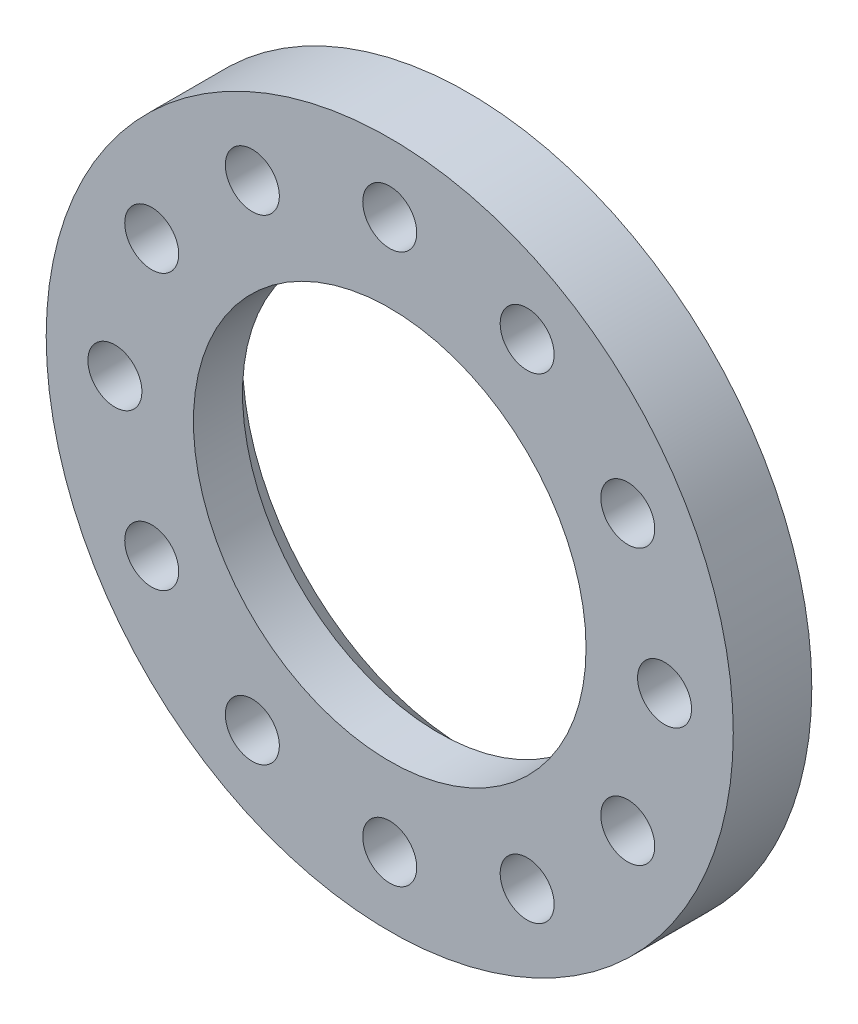
ISO-10303-21;
HEADER;
FILE_DESCRIPTION(('STEP AP214'),'2;1');
FILE_NAME('part.step','',(''),(''),'','','');
FILE_SCHEMA(('AUTOMOTIVE_DESIGN { 1 0 10303 214 1 1 1 1 }'));
ENDSEC;
DATA;
#1=APPLICATION_CONTEXT('core data for automotive mechanical design processes');
#2=APPLICATION_PROTOCOL_DEFINITION('international standard','automotive_design',2000,#1);
#3=PRODUCT_CONTEXT('',#1,'mechanical');
#4=PRODUCT('Part','Part','',(#3));
#5=PRODUCT_RELATED_PRODUCT_CATEGORY('part','',(#4));
#6=PRODUCT_DEFINITION_FORMATION('','',#4);
#7=PRODUCT_DEFINITION_CONTEXT('part definition',#1,'design');
#8=PRODUCT_DEFINITION('design','',#6,#7);
#9=PRODUCT_DEFINITION_SHAPE('','',#8);
#10=(LENGTH_UNIT() NAMED_UNIT(*) SI_UNIT(.MILLI.,.METRE.));
#11=(NAMED_UNIT(*) PLANE_ANGLE_UNIT() SI_UNIT($,.RADIAN.));
#12=(NAMED_UNIT(*) SI_UNIT($,.STERADIAN.) SOLID_ANGLE_UNIT());
#13=UNCERTAINTY_MEASURE_WITH_UNIT(LENGTH_MEASURE(1.E-05),#10,'distance_accuracy_value','');
#14=(GEOMETRIC_REPRESENTATION_CONTEXT(3) GLOBAL_UNCERTAINTY_ASSIGNED_CONTEXT((#13)) GLOBAL_UNIT_ASSIGNED_CONTEXT((#10,
#11,#12)) REPRESENTATION_CONTEXT('',''));
#15=CARTESIAN_POINT('',(0.,0.,0.));
#16=DIRECTION('',(0.,0.,1.));
#17=DIRECTION('',(1.,0.,0.));
#18=AXIS2_PLACEMENT_3D('',#15,#16,#17);
#19=CARTESIAN_POINT('',(0.,0.,-464.));
#20=DIRECTION('',(0.,0.,1.));
#21=DIRECTION('',(1.,0.,0.));
#22=AXIS2_PLACEMENT_3D('',#19,#20,#21);
#23=PLANE('',#22);
#24=CARTESIAN_POINT('',(24.2487113059641,14.0000000000002,-464.));
#25=DIRECTION('',(0.,0.,-1.));
#26=DIRECTION('',(-1.,0.,0.));
#27=AXIS2_PLACEMENT_3D('',#24,#25,#26);
#28=CIRCLE('',#27,2.75);
#29=CARTESIAN_POINT('',(21.4987113059641,14.0000000000002,-464.));
#30=VERTEX_POINT('',#29);
#31=EDGE_CURVE('E132',#30,#30,#28,.T.);
#32=ORIENTED_EDGE('',*,*,#31,.F.);
#33=EDGE_LOOP('',(#32));
#34=FACE_BOUND('',#33,.T.);
#35=CARTESIAN_POINT('',(13.9999999999997,24.2487113059645,-464.));
#36=DIRECTION('',(0.,0.,-1.));
#37=DIRECTION('',(-1.,0.,0.));
#38=AXIS2_PLACEMENT_3D('',#35,#36,#37);
#39=CIRCLE('',#38,2.75);
#40=CARTESIAN_POINT('',(11.2499999999997,24.2487113059645,-464.));
#41=VERTEX_POINT('',#40);
#42=EDGE_CURVE('E126',#41,#41,#39,.T.);
#43=ORIENTED_EDGE('',*,*,#42,.F.);
#44=EDGE_LOOP('',(#43));
#45=FACE_BOUND('',#44,.T.);
#46=CARTESIAN_POINT('',(0.,28.,-464.));
#47=DIRECTION('',(0.,0.,-1.));
#48=DIRECTION('',(-1.,0.,0.));
#49=AXIS2_PLACEMENT_3D('',#46,#47,#48);
#50=CIRCLE('',#49,2.75);
#51=CARTESIAN_POINT('',(-2.75,28.,-464.));
#52=VERTEX_POINT('',#51);
#53=EDGE_CURVE('E120',#52,#52,#50,.T.);
#54=ORIENTED_EDGE('',*,*,#53,.F.);
#55=EDGE_LOOP('',(#54));
#56=FACE_BOUND('',#55,.T.);
#57=CARTESIAN_POINT('',(-14.,24.2487113059643,-464.));
#58=DIRECTION('',(0.,0.,-1.));
#59=DIRECTION('',(-1.,0.,0.));
#60=AXIS2_PLACEMENT_3D('',#57,#58,#59);
#61=CIRCLE('',#60,2.75);
#62=CARTESIAN_POINT('',(-16.75,24.2487113059643,-464.));
#63=VERTEX_POINT('',#62);
#64=EDGE_CURVE('E114',#63,#63,#61,.T.);
#65=ORIENTED_EDGE('',*,*,#64,.F.);
#66=EDGE_LOOP('',(#65));
#67=FACE_BOUND('',#66,.T.);
#68=CARTESIAN_POINT('',(-24.2487113059643,13.9999999999999,-464.));
#69=DIRECTION('',(0.,0.,-1.));
#70=DIRECTION('',(-1.,0.,0.));
#71=AXIS2_PLACEMENT_3D('',#68,#69,#70);
#72=CIRCLE('',#71,2.75);
#73=CARTESIAN_POINT('',(-26.9987113059643,13.9999999999999,-464.));
#74=VERTEX_POINT('',#73);
#75=EDGE_CURVE('E108',#74,#74,#72,.T.);
#76=ORIENTED_EDGE('',*,*,#75,.F.);
#77=EDGE_LOOP('',(#76));
#78=FACE_BOUND('',#77,.T.);
#79=CARTESIAN_POINT('',(-28.,-1.11022302462516E-13,-464.));
#80=DIRECTION('',(0.,0.,-1.));
#81=DIRECTION('',(-1.,0.,0.));
#82=AXIS2_PLACEMENT_3D('',#79,#80,#81);
#83=CIRCLE('',#82,2.75);
#84=CARTESIAN_POINT('',(-30.75,-1.11022302462516E-13,-464.));
#85=VERTEX_POINT('',#84);
#86=EDGE_CURVE('E102',#85,#85,#83,.T.);
#87=ORIENTED_EDGE('',*,*,#86,.F.);
#88=EDGE_LOOP('',(#87));
#89=FACE_BOUND('',#88,.T.);
#90=CARTESIAN_POINT('',(-24.2487113059642,-14.0000000000001,-464.));
#91=DIRECTION('',(0.,0.,-1.));
#92=DIRECTION('',(-1.,0.,0.));
#93=AXIS2_PLACEMENT_3D('',#90,#91,#92);
#94=CIRCLE('',#93,2.75);
#95=CARTESIAN_POINT('',(-26.9987113059642,-14.0000000000001,-464.));
#96=VERTEX_POINT('',#95);
#97=EDGE_CURVE('E96',#96,#96,#94,.T.);
#98=ORIENTED_EDGE('',*,*,#97,.F.);
#99=EDGE_LOOP('',(#98));
#100=FACE_BOUND('',#99,.T.);
#101=CARTESIAN_POINT('',(-13.9999999999999,-24.2487113059644,-464.));
#102=DIRECTION('',(0.,0.,-1.));
#103=DIRECTION('',(-1.,0.,0.));
#104=AXIS2_PLACEMENT_3D('',#101,#102,#103);
#105=CIRCLE('',#104,2.75);
#106=CARTESIAN_POINT('',(-16.7499999999999,-24.2487113059644,-464.));
#107=VERTEX_POINT('',#106);
#108=EDGE_CURVE('E90',#107,#107,#105,.T.);
#109=ORIENTED_EDGE('',*,*,#108,.F.);
#110=EDGE_LOOP('',(#109));
#111=FACE_BOUND('',#110,.T.);
#112=CARTESIAN_POINT('',(0.,-28.,-464.));
#113=DIRECTION('',(0.,0.,-1.));
#114=DIRECTION('',(-1.,0.,0.));
#115=AXIS2_PLACEMENT_3D('',#112,#113,#114);
#116=CIRCLE('',#115,2.75);
#117=CARTESIAN_POINT('',(-2.75,-28.,-464.));
#118=VERTEX_POINT('',#117);
#119=EDGE_CURVE('E84',#118,#118,#116,.T.);
#120=ORIENTED_EDGE('',*,*,#119,.F.);
#121=EDGE_LOOP('',(#120));
#122=FACE_BOUND('',#121,.T.);
#123=CARTESIAN_POINT('',(14.0000000000002,-24.2487113059642,-464.));
#124=DIRECTION('',(0.,0.,-1.));
#125=DIRECTION('',(-1.,0.,0.));
#126=AXIS2_PLACEMENT_3D('',#123,#124,#125);
#127=CIRCLE('',#126,2.75);
#128=CARTESIAN_POINT('',(11.2500000000002,-24.2487113059642,-464.));
#129=VERTEX_POINT('',#128);
#130=EDGE_CURVE('E78',#129,#129,#127,.T.);
#131=ORIENTED_EDGE('',*,*,#130,.F.);
#132=EDGE_LOOP('',(#131));
#133=FACE_BOUND('',#132,.T.);
#134=CARTESIAN_POINT('',(24.2487113059644,-13.9999999999998,-464.));
#135=DIRECTION('',(0.,0.,-1.));
#136=DIRECTION('',(-1.,0.,0.));
#137=AXIS2_PLACEMENT_3D('',#134,#135,#136);
#138=CIRCLE('',#137,2.75);
#139=CARTESIAN_POINT('',(21.4987113059644,-13.9999999999998,-464.));
#140=VERTEX_POINT('',#139);
#141=EDGE_CURVE('E72',#140,#140,#138,.T.);
#142=ORIENTED_EDGE('',*,*,#141,.F.);
#143=EDGE_LOOP('',(#142));
#144=FACE_BOUND('',#143,.T.);
#145=CARTESIAN_POINT('',(0.,0.,-464.));
#146=DIRECTION('',(0.,0.,1.));
#147=DIRECTION('',(1.,0.,0.));
#148=AXIS2_PLACEMENT_3D('',#145,#146,#147);
#149=CIRCLE('',#148,34.9999999999999);
#150=CARTESIAN_POINT('',(34.9999999999999,0.,-464.));
#151=VERTEX_POINT('',#150);
#152=EDGE_CURVE('E60',#151,#151,#149,.T.);
#153=ORIENTED_EDGE('',*,*,#152,.F.);
#154=EDGE_LOOP('',(#153));
#155=FACE_BOUND('',#154,.T.);
#156=CARTESIAN_POINT('',(0.,0.,-464.));
#157=DIRECTION('',(0.,0.,1.));
#158=DIRECTION('',(1.,0.,0.));
#159=AXIS2_PLACEMENT_3D('',#156,#157,#158);
#160=CIRCLE('',#159,22.9999999999999);
#161=CARTESIAN_POINT('',(22.9999999999999,0.,-464.));
#162=VERTEX_POINT('',#161);
#163=EDGE_CURVE('E47',#162,#162,#160,.T.);
#164=ORIENTED_EDGE('',*,*,#163,.T.);
#165=EDGE_LOOP('',(#164));
#166=FACE_BOUND('',#165,.T.);
#167=CARTESIAN_POINT('',(28.,3.33066907387547E-13,-464.));
#168=DIRECTION('',(0.,0.,-1.));
#169=DIRECTION('',(-1.,0.,0.));
#170=AXIS2_PLACEMENT_3D('',#167,#168,#169);
#171=CIRCLE('',#170,2.75);
#172=CARTESIAN_POINT('',(25.25,3.33066907387547E-13,-464.));
#173=VERTEX_POINT('',#172);
#174=EDGE_CURVE('E66',#173,#173,#171,.T.);
#175=ORIENTED_EDGE('',*,*,#174,.F.);
#176=EDGE_LOOP('',(#175));
#177=FACE_BOUND('',#176,.T.);
#178=ADVANCED_FACE('F40',(#34,#45,#56,#67,#78,#89,#100,#111,#122,#133,#144,#155,#166,#177),#23,.F.);
#179=CARTESIAN_POINT('',(0.,0.,0.));
#180=DIRECTION('',(0.,0.,1.));
#181=DIRECTION('',(1.,0.,0.));
#182=AXIS2_PLACEMENT_3D('',#179,#180,#181);
#183=CYLINDRICAL_SURFACE('',#182,34.9999999999999);
#184=CARTESIAN_POINT('',(0.,0.,-456.));
#185=DIRECTION('',(0.,0.,1.));
#186=DIRECTION('',(1.,0.,0.));
#187=AXIS2_PLACEMENT_3D('',#184,#185,#186);
#188=CIRCLE('',#187,34.9999999999999);
#189=CARTESIAN_POINT('',(34.9999999999999,0.,-456.));
#190=VERTEX_POINT('',#189);
#191=EDGE_CURVE('E51',#190,#190,#188,.T.);
#192=ORIENTED_EDGE('',*,*,#191,.F.);
#193=EDGE_LOOP('',(#192));
#194=FACE_BOUND('',#193,.T.);
#195=ORIENTED_EDGE('',*,*,#152,.T.);
#196=EDGE_LOOP('',(#195));
#197=FACE_BOUND('',#196,.T.);
#198=ADVANCED_FACE('F140',(#194,#197),#183,.T.);
#199=CARTESIAN_POINT('',(0.,0.,-456.));
#200=DIRECTION('',(0.,0.,-1.));
#201=DIRECTION('',(-1.,0.,0.));
#202=AXIS2_PLACEMENT_3D('',#199,#200,#201);
#203=PLANE('',#202);
#204=CARTESIAN_POINT('',(24.2487113059641,14.0000000000002,-456.));
#205=DIRECTION('',(0.,0.,-1.));
#206=DIRECTION('',(-1.,0.,0.));
#207=AXIS2_PLACEMENT_3D('',#204,#205,#206);
#208=CIRCLE('',#207,2.75);
#209=CARTESIAN_POINT('',(21.4987113059641,14.0000000000002,-456.));
#210=VERTEX_POINT('',#209);
#211=EDGE_CURVE('E129',#210,#210,#208,.T.);
#212=ORIENTED_EDGE('',*,*,#211,.T.);
#213=EDGE_LOOP('',(#212));
#214=FACE_BOUND('',#213,.T.);
#215=CARTESIAN_POINT('',(13.9999999999997,24.2487113059645,-456.));
#216=DIRECTION('',(0.,0.,-1.));
#217=DIRECTION('',(-1.,0.,0.));
#218=AXIS2_PLACEMENT_3D('',#215,#216,#217);
#219=CIRCLE('',#218,2.75);
#220=CARTESIAN_POINT('',(11.2499999999997,24.2487113059645,-456.));
#221=VERTEX_POINT('',#220);
#222=EDGE_CURVE('E123',#221,#221,#219,.T.);
#223=ORIENTED_EDGE('',*,*,#222,.T.);
#224=EDGE_LOOP('',(#223));
#225=FACE_BOUND('',#224,.T.);
#226=CARTESIAN_POINT('',(0.,28.,-456.));
#227=DIRECTION('',(0.,0.,-1.));
#228=DIRECTION('',(-1.,0.,0.));
#229=AXIS2_PLACEMENT_3D('',#226,#227,#228);
#230=CIRCLE('',#229,2.75);
#231=CARTESIAN_POINT('',(-2.75,28.,-456.));
#232=VERTEX_POINT('',#231);
#233=EDGE_CURVE('E117',#232,#232,#230,.T.);
#234=ORIENTED_EDGE('',*,*,#233,.T.);
#235=EDGE_LOOP('',(#234));
#236=FACE_BOUND('',#235,.T.);
#237=CARTESIAN_POINT('',(-14.,24.2487113059643,-456.));
#238=DIRECTION('',(0.,0.,-1.));
#239=DIRECTION('',(-1.,0.,0.));
#240=AXIS2_PLACEMENT_3D('',#237,#238,#239);
#241=CIRCLE('',#240,2.75);
#242=CARTESIAN_POINT('',(-16.75,24.2487113059643,-456.));
#243=VERTEX_POINT('',#242);
#244=EDGE_CURVE('E111',#243,#243,#241,.T.);
#245=ORIENTED_EDGE('',*,*,#244,.T.);
#246=EDGE_LOOP('',(#245));
#247=FACE_BOUND('',#246,.T.);
#248=CARTESIAN_POINT('',(-24.2487113059643,13.9999999999999,-456.));
#249=DIRECTION('',(0.,0.,-1.));
#250=DIRECTION('',(-1.,0.,0.));
#251=AXIS2_PLACEMENT_3D('',#248,#249,#250);
#252=CIRCLE('',#251,2.75);
#253=CARTESIAN_POINT('',(-26.9987113059643,13.9999999999999,-456.));
#254=VERTEX_POINT('',#253);
#255=EDGE_CURVE('E105',#254,#254,#252,.T.);
#256=ORIENTED_EDGE('',*,*,#255,.T.);
#257=EDGE_LOOP('',(#256));
#258=FACE_BOUND('',#257,.T.);
#259=CARTESIAN_POINT('',(-28.,-1.11022302462516E-13,-456.));
#260=DIRECTION('',(0.,0.,-1.));
#261=DIRECTION('',(-1.,0.,0.));
#262=AXIS2_PLACEMENT_3D('',#259,#260,#261);
#263=CIRCLE('',#262,2.75);
#264=CARTESIAN_POINT('',(-30.75,-1.11022302462516E-13,-456.));
#265=VERTEX_POINT('',#264);
#266=EDGE_CURVE('E99',#265,#265,#263,.T.);
#267=ORIENTED_EDGE('',*,*,#266,.T.);
#268=EDGE_LOOP('',(#267));
#269=FACE_BOUND('',#268,.T.);
#270=CARTESIAN_POINT('',(-24.2487113059642,-14.0000000000001,-456.));
#271=DIRECTION('',(0.,0.,-1.));
#272=DIRECTION('',(-1.,0.,0.));
#273=AXIS2_PLACEMENT_3D('',#270,#271,#272);
#274=CIRCLE('',#273,2.75);
#275=CARTESIAN_POINT('',(-26.9987113059642,-14.0000000000001,-456.));
#276=VERTEX_POINT('',#275);
#277=EDGE_CURVE('E93',#276,#276,#274,.T.);
#278=ORIENTED_EDGE('',*,*,#277,.T.);
#279=EDGE_LOOP('',(#278));
#280=FACE_BOUND('',#279,.T.);
#281=CARTESIAN_POINT('',(-13.9999999999999,-24.2487113059644,-456.));
#282=DIRECTION('',(0.,0.,-1.));
#283=DIRECTION('',(-1.,0.,0.));
#284=AXIS2_PLACEMENT_3D('',#281,#282,#283);
#285=CIRCLE('',#284,2.75);
#286=CARTESIAN_POINT('',(-16.7499999999999,-24.2487113059644,-456.));
#287=VERTEX_POINT('',#286);
#288=EDGE_CURVE('E87',#287,#287,#285,.T.);
#289=ORIENTED_EDGE('',*,*,#288,.T.);
#290=EDGE_LOOP('',(#289));
#291=FACE_BOUND('',#290,.T.);
#292=CARTESIAN_POINT('',(0.,-28.,-456.));
#293=DIRECTION('',(0.,0.,-1.));
#294=DIRECTION('',(-1.,0.,0.));
#295=AXIS2_PLACEMENT_3D('',#292,#293,#294);
#296=CIRCLE('',#295,2.75);
#297=CARTESIAN_POINT('',(-2.75,-28.,-456.));
#298=VERTEX_POINT('',#297);
#299=EDGE_CURVE('E81',#298,#298,#296,.T.);
#300=ORIENTED_EDGE('',*,*,#299,.T.);
#301=EDGE_LOOP('',(#300));
#302=FACE_BOUND('',#301,.T.);
#303=CARTESIAN_POINT('',(14.0000000000002,-24.2487113059642,-456.));
#304=DIRECTION('',(0.,0.,-1.));
#305=DIRECTION('',(-1.,0.,0.));
#306=AXIS2_PLACEMENT_3D('',#303,#304,#305);
#307=CIRCLE('',#306,2.75);
#308=CARTESIAN_POINT('',(11.2500000000002,-24.2487113059642,-456.));
#309=VERTEX_POINT('',#308);
#310=EDGE_CURVE('E75',#309,#309,#307,.T.);
#311=ORIENTED_EDGE('',*,*,#310,.T.);
#312=EDGE_LOOP('',(#311));
#313=FACE_BOUND('',#312,.T.);
#314=CARTESIAN_POINT('',(24.2487113059644,-13.9999999999998,-456.));
#315=DIRECTION('',(0.,0.,-1.));
#316=DIRECTION('',(-1.,0.,0.));
#317=AXIS2_PLACEMENT_3D('',#314,#315,#316);
#318=CIRCLE('',#317,2.75);
#319=CARTESIAN_POINT('',(21.4987113059644,-13.9999999999998,-456.));
#320=VERTEX_POINT('',#319);
#321=EDGE_CURVE('E69',#320,#320,#318,.T.);
#322=ORIENTED_EDGE('',*,*,#321,.T.);
#323=EDGE_LOOP('',(#322));
#324=FACE_BOUND('',#323,.T.);
#325=CARTESIAN_POINT('',(28.,3.33066907387547E-13,-456.));
#326=DIRECTION('',(0.,0.,-1.));
#327=DIRECTION('',(-1.,0.,0.));
#328=AXIS2_PLACEMENT_3D('',#325,#326,#327);
#329=CIRCLE('',#328,2.75);
#330=CARTESIAN_POINT('',(25.25,3.33066907387547E-13,-456.));
#331=VERTEX_POINT('',#330);
#332=EDGE_CURVE('E63',#331,#331,#329,.T.);
#333=ORIENTED_EDGE('',*,*,#332,.T.);
#334=EDGE_LOOP('',(#333));
#335=FACE_BOUND('',#334,.T.);
#336=CARTESIAN_POINT('',(0.,0.,-456.));
#337=DIRECTION('',(0.,0.,1.));
#338=DIRECTION('',(1.,0.,0.));
#339=AXIS2_PLACEMENT_3D('',#336,#337,#338);
#340=CIRCLE('',#339,19.9999999999999);
#341=CARTESIAN_POINT('',(19.9999999999999,0.,-456.));
#342=VERTEX_POINT('',#341);
#343=EDGE_CURVE('E55',#342,#342,#340,.T.);
#344=ORIENTED_EDGE('',*,*,#343,.F.);
#345=EDGE_LOOP('',(#344));
#346=FACE_BOUND('',#345,.T.);
#347=ORIENTED_EDGE('',*,*,#191,.T.);
#348=EDGE_LOOP('',(#347));
#349=FACE_BOUND('',#348,.T.);
#350=ADVANCED_FACE('F185',(#214,#225,#236,#247,#258,#269,#280,#291,#302,#313,#324,#335,#346,
#349),#203,.F.);
#351=CARTESIAN_POINT('',(0.,0.,0.));
#352=DIRECTION('',(0.,0.,1.));
#353=DIRECTION('',(1.,0.,0.));
#354=AXIS2_PLACEMENT_3D('',#351,#352,#353);
#355=CYLINDRICAL_SURFACE('',#354,19.9999999999999);
#356=CARTESIAN_POINT('',(0.,0.,-461.));
#357=DIRECTION('',(0.,0.,1.));
#358=DIRECTION('',(1.,0.,0.));
#359=AXIS2_PLACEMENT_3D('',#356,#357,#358);
#360=CIRCLE('',#359,19.9999999999999);
#361=CARTESIAN_POINT('',(19.9999999999999,0.,-461.));
#362=VERTEX_POINT('',#361);
#363=EDGE_CURVE('E11',#362,#362,#360,.F.);
#364=ORIENTED_EDGE('',*,*,#363,.T.);
#365=EDGE_LOOP('',(#364));
#366=FACE_BOUND('',#365,.T.);
#367=ORIENTED_EDGE('',*,*,#343,.T.);
#368=EDGE_LOOP('',(#367));
#369=FACE_BOUND('',#368,.T.);
#370=ADVANCED_FACE('F178',(#366,#369),#355,.F.);
#371=CARTESIAN_POINT('',(0.,0.,-464.));
#372=DIRECTION('',(0.,0.,-1.));
#373=DIRECTION('',(-1.,0.,0.));
#374=AXIS2_PLACEMENT_3D('',#371,#372,#373);
#375=CONICAL_SURFACE('',#374,22.9999999999999,0.785398163397447);
#376=ORIENTED_EDGE('',*,*,#363,.F.);
#377=EDGE_LOOP('',(#376));
#378=FACE_BOUND('',#377,.T.);
#379=ORIENTED_EDGE('',*,*,#163,.F.);
#380=EDGE_LOOP('',(#379));
#381=FACE_BOUND('',#380,.T.);
#382=ADVANCED_FACE('F42',(#378,#381),#375,.F.);
#383=CARTESIAN_POINT('',(28.,3.33066907387547E-13,-464.));
#384=DIRECTION('',(0.,0.,-1.));
#385=DIRECTION('',(-1.,0.,0.));
#386=AXIS2_PLACEMENT_3D('',#383,#384,#385);
#387=CYLINDRICAL_SURFACE('',#386,2.75);
#388=ORIENTED_EDGE('',*,*,#332,.F.);
#389=EDGE_LOOP('',(#388));
#390=FACE_BOUND('',#389,.T.);
#391=ORIENTED_EDGE('',*,*,#174,.T.);
#392=EDGE_LOOP('',(#391));
#393=FACE_BOUND('',#392,.T.);
#394=ADVANCED_FACE('F166',(#390,#393),#387,.F.);
#395=CARTESIAN_POINT('',(24.2487113059644,-13.9999999999998,-464.));
#396=DIRECTION('',(0.,0.,-1.));
#397=DIRECTION('',(-1.,0.,0.));
#398=AXIS2_PLACEMENT_3D('',#395,#396,#397);
#399=CYLINDRICAL_SURFACE('',#398,2.75);
#400=ORIENTED_EDGE('',*,*,#321,.F.);
#401=EDGE_LOOP('',(#400));
#402=FACE_BOUND('',#401,.T.);
#403=ORIENTED_EDGE('',*,*,#141,.T.);
#404=EDGE_LOOP('',(#403));
#405=FACE_BOUND('',#404,.T.);
#406=ADVANCED_FACE('F168',(#402,#405),#399,.F.);
#407=CARTESIAN_POINT('',(14.0000000000002,-24.2487113059642,-464.));
#408=DIRECTION('',(0.,0.,-1.));
#409=DIRECTION('',(-1.,0.,0.));
#410=AXIS2_PLACEMENT_3D('',#407,#408,#409);
#411=CYLINDRICAL_SURFACE('',#410,2.75);
#412=ORIENTED_EDGE('',*,*,#310,.F.);
#413=EDGE_LOOP('',(#412));
#414=FACE_BOUND('',#413,.T.);
#415=ORIENTED_EDGE('',*,*,#130,.T.);
#416=EDGE_LOOP('',(#415));
#417=FACE_BOUND('',#416,.T.);
#418=ADVANCED_FACE('F175',(#414,#417),#411,.F.);
#419=CARTESIAN_POINT('',(0.,-28.,-464.));
#420=DIRECTION('',(0.,0.,-1.));
#421=DIRECTION('',(-1.,0.,0.));
#422=AXIS2_PLACEMENT_3D('',#419,#420,#421);
#423=CYLINDRICAL_SURFACE('',#422,2.75);
#424=ORIENTED_EDGE('',*,*,#299,.F.);
#425=EDGE_LOOP('',(#424));
#426=FACE_BOUND('',#425,.T.);
#427=ORIENTED_EDGE('',*,*,#119,.T.);
#428=EDGE_LOOP('',(#427));
#429=FACE_BOUND('',#428,.T.);
#430=ADVANCED_FACE('F228',(#426,#429),#423,.F.);
#431=CARTESIAN_POINT('',(-13.9999999999999,-24.2487113059644,-464.));
#432=DIRECTION('',(0.,0.,-1.));
#433=DIRECTION('',(-1.,0.,0.));
#434=AXIS2_PLACEMENT_3D('',#431,#432,#433);
#435=CYLINDRICAL_SURFACE('',#434,2.75);
#436=ORIENTED_EDGE('',*,*,#288,.F.);
#437=EDGE_LOOP('',(#436));
#438=FACE_BOUND('',#437,.T.);
#439=ORIENTED_EDGE('',*,*,#108,.T.);
#440=EDGE_LOOP('',(#439));
#441=FACE_BOUND('',#440,.T.);
#442=ADVANCED_FACE('F236',(#438,#441),#435,.F.);
#443=CARTESIAN_POINT('',(-24.2487113059642,-14.0000000000001,-464.));
#444=DIRECTION('',(0.,0.,-1.));
#445=DIRECTION('',(-1.,0.,0.));
#446=AXIS2_PLACEMENT_3D('',#443,#444,#445);
#447=CYLINDRICAL_SURFACE('',#446,2.75);
#448=ORIENTED_EDGE('',*,*,#277,.F.);
#449=EDGE_LOOP('',(#448));
#450=FACE_BOUND('',#449,.T.);
#451=ORIENTED_EDGE('',*,*,#97,.T.);
#452=EDGE_LOOP('',(#451));
#453=FACE_BOUND('',#452,.T.);
#454=ADVANCED_FACE('F245',(#450,#453),#447,.F.);
#455=CARTESIAN_POINT('',(-28.,-1.11022302462516E-13,-464.));
#456=DIRECTION('',(0.,0.,-1.));
#457=DIRECTION('',(-1.,0.,0.));
#458=AXIS2_PLACEMENT_3D('',#455,#456,#457);
#459=CYLINDRICAL_SURFACE('',#458,2.75);
#460=ORIENTED_EDGE('',*,*,#266,.F.);
#461=EDGE_LOOP('',(#460));
#462=FACE_BOUND('',#461,.T.);
#463=ORIENTED_EDGE('',*,*,#86,.T.);
#464=EDGE_LOOP('',(#463));
#465=FACE_BOUND('',#464,.T.);
#466=ADVANCED_FACE('F254',(#462,#465),#459,.F.);
#467=CARTESIAN_POINT('',(-24.2487113059643,13.9999999999999,-464.));
#468=DIRECTION('',(0.,0.,-1.));
#469=DIRECTION('',(-1.,0.,0.));
#470=AXIS2_PLACEMENT_3D('',#467,#468,#469);
#471=CYLINDRICAL_SURFACE('',#470,2.75);
#472=ORIENTED_EDGE('',*,*,#255,.F.);
#473=EDGE_LOOP('',(#472));
#474=FACE_BOUND('',#473,.T.);
#475=ORIENTED_EDGE('',*,*,#75,.T.);
#476=EDGE_LOOP('',(#475));
#477=FACE_BOUND('',#476,.T.);
#478=ADVANCED_FACE('F263',(#474,#477),#471,.F.);
#479=CARTESIAN_POINT('',(-14.,24.2487113059643,-464.));
#480=DIRECTION('',(0.,0.,-1.));
#481=DIRECTION('',(-1.,0.,0.));
#482=AXIS2_PLACEMENT_3D('',#479,#480,#481);
#483=CYLINDRICAL_SURFACE('',#482,2.75);
#484=ORIENTED_EDGE('',*,*,#244,.F.);
#485=EDGE_LOOP('',(#484));
#486=FACE_BOUND('',#485,.T.);
#487=ORIENTED_EDGE('',*,*,#64,.T.);
#488=EDGE_LOOP('',(#487));
#489=FACE_BOUND('',#488,.T.);
#490=ADVANCED_FACE('F272',(#486,#489),#483,.F.);
#491=CARTESIAN_POINT('',(0.,28.,-464.));
#492=DIRECTION('',(0.,0.,-1.));
#493=DIRECTION('',(-1.,0.,0.));
#494=AXIS2_PLACEMENT_3D('',#491,#492,#493);
#495=CYLINDRICAL_SURFACE('',#494,2.75);
#496=ORIENTED_EDGE('',*,*,#233,.F.);
#497=EDGE_LOOP('',(#496));
#498=FACE_BOUND('',#497,.T.);
#499=ORIENTED_EDGE('',*,*,#53,.T.);
#500=EDGE_LOOP('',(#499));
#501=FACE_BOUND('',#500,.T.);
#502=ADVANCED_FACE('F281',(#498,#501),#495,.F.);
#503=CARTESIAN_POINT('',(13.9999999999997,24.2487113059645,-464.));
#504=DIRECTION('',(0.,0.,-1.));
#505=DIRECTION('',(-1.,0.,0.));
#506=AXIS2_PLACEMENT_3D('',#503,#504,#505);
#507=CYLINDRICAL_SURFACE('',#506,2.75);
#508=ORIENTED_EDGE('',*,*,#222,.F.);
#509=EDGE_LOOP('',(#508));
#510=FACE_BOUND('',#509,.T.);
#511=ORIENTED_EDGE('',*,*,#42,.T.);
#512=EDGE_LOOP('',(#511));
#513=FACE_BOUND('',#512,.T.);
#514=ADVANCED_FACE('F290',(#510,#513),#507,.F.);
#515=CARTESIAN_POINT('',(24.2487113059641,14.0000000000002,-464.));
#516=DIRECTION('',(0.,0.,-1.));
#517=DIRECTION('',(-1.,0.,0.));
#518=AXIS2_PLACEMENT_3D('',#515,#516,#517);
#519=CYLINDRICAL_SURFACE('',#518,2.75);
#520=ORIENTED_EDGE('',*,*,#211,.F.);
#521=EDGE_LOOP('',(#520));
#522=FACE_BOUND('',#521,.T.);
#523=ORIENTED_EDGE('',*,*,#31,.T.);
#524=EDGE_LOOP('',(#523));
#525=FACE_BOUND('',#524,.T.);
#526=ADVANCED_FACE('F136',(#522,#525),#519,.F.);
#527=CLOSED_SHELL('',(#178,#198,#350,#370,#382,#394,#406,#418,#430,#442,#454,#466,#478,#490,
#502,#514,#526));
#528=MANIFOLD_SOLID_BREP('B2',#527);
#529=ADVANCED_BREP_SHAPE_REPRESENTATION('',(#18,#528),#14);
#530=SHAPE_DEFINITION_REPRESENTATION(#9,#529);
ENDSEC;
END-ISO-10303-21;
